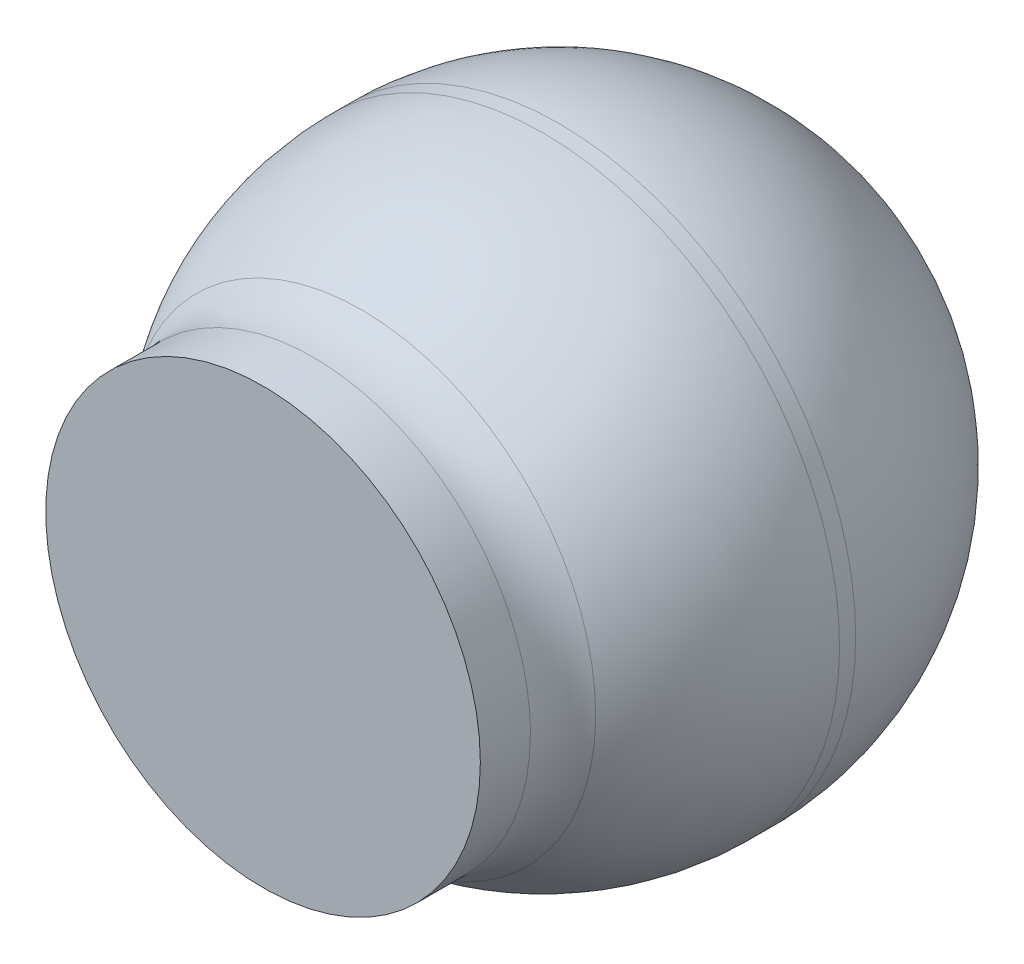
ISO-10303-21;
HEADER;
FILE_DESCRIPTION(('STEP AP214'),'2;1');
FILE_NAME('part.step','',(''),(''),'','','');
FILE_SCHEMA(('AUTOMOTIVE_DESIGN { 1 0 10303 214 1 1 1 1 }'));
ENDSEC;
DATA;
#1=APPLICATION_CONTEXT('core data for automotive mechanical design processes');
#2=APPLICATION_PROTOCOL_DEFINITION('international standard','automotive_design',2000,#1);
#3=PRODUCT_CONTEXT('',#1,'mechanical');
#4=PRODUCT('Part','Part','',(#3));
#5=PRODUCT_RELATED_PRODUCT_CATEGORY('part','',(#4));
#6=PRODUCT_DEFINITION_FORMATION('','',#4);
#7=PRODUCT_DEFINITION_CONTEXT('part definition',#1,'design');
#8=PRODUCT_DEFINITION('design','',#6,#7);
#9=PRODUCT_DEFINITION_SHAPE('','',#8);
#10=(LENGTH_UNIT() NAMED_UNIT(*) SI_UNIT(.MILLI.,.METRE.));
#11=(NAMED_UNIT(*) PLANE_ANGLE_UNIT() SI_UNIT($,.RADIAN.));
#12=(NAMED_UNIT(*) SI_UNIT($,.STERADIAN.) SOLID_ANGLE_UNIT());
#13=UNCERTAINTY_MEASURE_WITH_UNIT(LENGTH_MEASURE(1.E-05),#10,'distance_accuracy_value','');
#14=(GEOMETRIC_REPRESENTATION_CONTEXT(3) GLOBAL_UNCERTAINTY_ASSIGNED_CONTEXT((#13)) GLOBAL_UNIT_ASSIGNED_CONTEXT((#10,
#11,#12)) REPRESENTATION_CONTEXT('',''));
#15=CARTESIAN_POINT('',(0.,0.,0.));
#16=DIRECTION('',(0.,0.,1.));
#17=DIRECTION('',(1.,0.,0.));
#18=AXIS2_PLACEMENT_3D('',#15,#16,#17);
#19=CARTESIAN_POINT('',(-0.562919922269,-0.241349291452,10.006534503384));
#20=DIRECTION('',(0.,0.,-1.));
#21=DIRECTION('',(-1.,0.,0.));
#22=AXIS2_PLACEMENT_3D('',#19,#20,#21);
#23=PLANE('',#22);
#24=CARTESIAN_POINT('',(-0.562919922269,-0.241349291452,10.006534503384));
#25=DIRECTION('',(0.,0.,1.));
#26=DIRECTION('',(1.,0.,0.));
#27=AXIS2_PLACEMENT_3D('',#24,#25,#26);
#28=CIRCLE('',#27,0.275);
#29=CARTESIAN_POINT('',(-0.287919922269,-0.241349291452,10.006534503384));
#30=VERTEX_POINT('',#29);
#31=EDGE_CURVE('E20',#30,#30,#28,.F.);
#32=ORIENTED_EDGE('',*,*,#31,.F.);
#33=EDGE_LOOP('',(#32));
#34=FACE_BOUND('',#33,.T.);
#35=ADVANCED_FACE('F17',(#34),#23,.F.);
#36=CARTESIAN_POINT('',(-0.562919922269,-0.241349291452,9.906534503384));
#37=DIRECTION('',(0.,0.,1.));
#38=DIRECTION('',(1.,0.,0.));
#39=AXIS2_PLACEMENT_3D('',#36,#37,#38);
#40=CYLINDRICAL_SURFACE('',#39,0.275);
#41=CARTESIAN_POINT('',(-0.562919922269,-0.241349291452,9.943180457728));
#42=DIRECTION('',(0.,0.,-1.));
#43=DIRECTION('',(0.996700902337583,0.081162252799246,0.));
#44=AXIS2_PLACEMENT_3D('',#41,#42,#43);
#45=CIRCLE('',#44,0.275);
#46=CARTESIAN_POINT('',(-0.288827174126165,-0.219029671932207,9.943180457728));
#47=VERTEX_POINT('',#46);
#48=EDGE_CURVE('E65',#47,#47,#45,.F.);
#49=ORIENTED_EDGE('',*,*,#48,.T.);
#50=EDGE_LOOP('',(#49));
#51=FACE_BOUND('',#50,.T.);
#52=ORIENTED_EDGE('',*,*,#31,.T.);
#53=EDGE_LOOP('',(#52));
#54=FACE_BOUND('',#53,.T.);
#55=ADVANCED_FACE('F62',(#51,#54),#40,.T.);
#56=CARTESIAN_POINT('',(-0.562919922269,-0.241349291452,9.943180457728));
#57=DIRECTION('',(0.,0.,-1.));
#58=DIRECTION('',(0.996700902337582,0.081162252799246,0.));
#59=AXIS2_PLACEMENT_3D('',#56,#57,#58);
#60=TOROIDAL_SURFACE('',#59,0.375,0.1);
#61=ORIENTED_EDGE('',*,*,#48,.F.);
#62=EDGE_LOOP('',(#61));
#63=FACE_BOUND('',#62,.T.);
#64=CARTESIAN_POINT('',(-0.562919922268999,-0.241349291452,9.881744931236));
#65=DIRECTION('',(0.,0.,-1.));
#66=DIRECTION('',(-0.996700902337598,-0.0811622527990606,0.));
#67=AXIS2_PLACEMENT_3D('',#64,#65,#66);
#68=CIRCLE('',#67,0.296097046412665);
#69=CARTESIAN_POINT('',(-0.858040115608,-0.265381194786,9.881744931236));
#70=VERTEX_POINT('',#69);
#71=EDGE_CURVE('E39',#70,#70,#68,.T.);
#72=ORIENTED_EDGE('',*,*,#71,.F.);
#73=EDGE_LOOP('',(#72));
#74=FACE_BOUND('',#73,.T.);
#75=ADVANCED_FACE('F57',(#63,#74),#60,.F.);
#76=CARTESIAN_POINT('',(-0.936682760645,-0.271785136252,9.651976062157));
#77=CARTESIAN_POINT('',(-0.936682760645,-0.271785136252,9.701461392103));
#78=CARTESIAN_POINT('',(-0.928526217348,-0.271120941579,9.750947004335));
#79=CARTESIAN_POINT('',(-0.912207085349,-0.269792059952,9.798626332798));
#80=CARTESIAN_POINT('',(-0.888341390838,-0.267848654938,9.842699544317));
#81=CARTESIAN_POINT('',(-0.858040115608,-0.265381194786,9.881744931236));
#82=(BOUNDED_CURVE() B_SPLINE_CURVE(5,(#76,#77,#78,#79,#80,#81),.UNSPECIFIED.,.F.,
.F.) B_SPLINE_CURVE_WITH_KNOTS((6,6),(0.,0.661568582165),
.UNSPECIFIED.) CURVE() GEOMETRIC_REPRESENTATION_ITEM() RATIONAL_B_SPLINE_CURVE((1.,1.,1.,1.,1.,1.)) REPRESENTATION_ITEM(''));
#83=CARTESIAN_POINT('',(-0.562919922269,-0.241349291452,9.651976062157));
#84=DIRECTION('',(0.,0.,-1.));
#85=AXIS1_PLACEMENT('',#83,#84);
#86=SURFACE_OF_REVOLUTION('',#82,#85);
#87=CARTESIAN_POINT('',(-0.562919922268999,-0.241349291452,9.651976062157));
#88=DIRECTION('',(0.,0.,1.));
#89=DIRECTION('',(1.,0.,0.));
#90=AXIS2_PLACEMENT_3D('',#87,#88,#89);
#91=CIRCLE('',#90,0.375);
#92=CARTESIAN_POINT('',(-0.187919922268999,-0.241349291452,9.651976062157));
#93=VERTEX_POINT('',#92);
#94=EDGE_CURVE('E36',#93,#93,#91,.F.);
#95=ORIENTED_EDGE('',*,*,#94,.F.);
#96=EDGE_LOOP('',(#95));
#97=FACE_BOUND('',#96,.T.);
#98=ORIENTED_EDGE('',*,*,#71,.T.);
#99=EDGE_LOOP('',(#98));
#100=FACE_BOUND('',#99,.T.);
#101=ADVANCED_FACE('F53',(#97,#100),#86,.F.);
#102=CARTESIAN_POINT('',(-0.562919922269,-0.241349291452,9.256534503384));
#103=DIRECTION('',(0.,0.,1.));
#104=DIRECTION('',(1.,0.,0.));
#105=AXIS2_PLACEMENT_3D('',#102,#103,#104);
#106=CYLINDRICAL_SURFACE('',#105,0.375);
#107=CARTESIAN_POINT('',(-0.562919922269,-0.241349291452,9.631534503384));
#108=DIRECTION('',(0.,0.,-1.));
#109=DIRECTION('',(0.0811622527992362,-0.996700902337583,0.));
#110=AXIS2_PLACEMENT_3D('',#107,#108,#109);
#111=CIRCLE('',#110,0.375);
#112=CARTESIAN_POINT('',(-0.532484077469287,-0.615112129828594,9.631534503384));
#113=VERTEX_POINT('',#112);
#114=CARTESIAN_POINT('',(-0.593355767068714,0.132413546924594,9.631534503384));
#115=VERTEX_POINT('',#114);
#116=EDGE_CURVE('E11',#113,#115,#111,.T.);
#117=ORIENTED_EDGE('',*,*,#116,.F.);
#118=CARTESIAN_POINT('',(-0.562919922269,-0.241349291452,9.631534503384));
#119=DIRECTION('',(0.,0.,1.));
#120=DIRECTION('',(0.081162252799236,-0.996700902337583,0.));
#121=AXIS2_PLACEMENT_3D('',#118,#119,#120);
#122=CIRCLE('',#121,0.375);
#123=EDGE_CURVE('E25',#115,#113,#122,.F.);
#124=ORIENTED_EDGE('',*,*,#123,.F.);
#125=EDGE_LOOP('',(#117,#124));
#126=FACE_BOUND('',#125,.T.);
#127=ORIENTED_EDGE('',*,*,#94,.T.);
#128=EDGE_LOOP('',(#127));
#129=FACE_BOUND('',#128,.T.);
#130=ADVANCED_FACE('F34',(#126,#129),#106,.T.);
#131=CARTESIAN_POINT('',(-0.562919922269,-0.241349291452,9.631534503384));
#132=DIRECTION('',(0.0811622527992361,-0.996700902337583,0.));
#133=DIRECTION('',(-0.996700902337583,-0.0811622527992361,0.));
#134=AXIS2_PLACEMENT_3D('',#131,#132,#133);
#135=SPHERICAL_SURFACE('',#134,0.375);
#136=ORIENTED_EDGE('',*,*,#123,.T.);
#137=ORIENTED_EDGE('',*,*,#116,.T.);
#138=EDGE_LOOP('',(#136,#137));
#139=FACE_BOUND('',#138,.T.);
#140=ADVANCED_FACE('F32',(#139),#135,.T.);
#141=CLOSED_SHELL('',(#35,#55,#75,#101,#130,#140));
#142=MANIFOLD_SOLID_BREP('B1',#141);
#143=ADVANCED_BREP_SHAPE_REPRESENTATION('',(#18,#142),#14);
#144=SHAPE_DEFINITION_REPRESENTATION(#9,#143);
ENDSEC;
END-ISO-10303-21;
